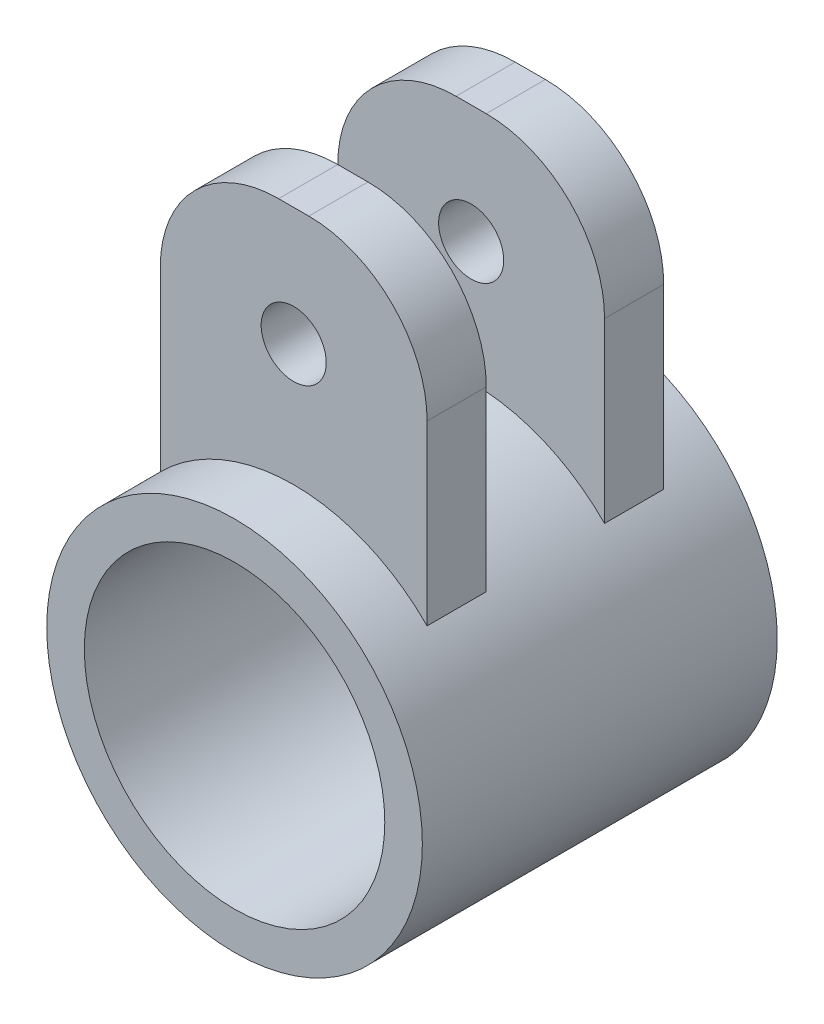
ISO-10303-21;
HEADER;
FILE_DESCRIPTION(('STEP AP214'),'2;1');
FILE_NAME('part.step','',(''),(''),'','','');
FILE_SCHEMA(('AUTOMOTIVE_DESIGN { 1 0 10303 214 1 1 1 1 }'));
ENDSEC;
DATA;
#1=APPLICATION_CONTEXT('core data for automotive mechanical design processes');
#2=APPLICATION_PROTOCOL_DEFINITION('international standard','automotive_design',2000,#1);
#3=PRODUCT_CONTEXT('',#1,'mechanical');
#4=PRODUCT('Part','Part','',(#3));
#5=PRODUCT_RELATED_PRODUCT_CATEGORY('part','',(#4));
#6=PRODUCT_DEFINITION_FORMATION('','',#4);
#7=PRODUCT_DEFINITION_CONTEXT('part definition',#1,'design');
#8=PRODUCT_DEFINITION('design','',#6,#7);
#9=PRODUCT_DEFINITION_SHAPE('','',#8);
#10=(LENGTH_UNIT() NAMED_UNIT(*) SI_UNIT(.MILLI.,.METRE.));
#11=(NAMED_UNIT(*) PLANE_ANGLE_UNIT() SI_UNIT($,.RADIAN.));
#12=(NAMED_UNIT(*) SI_UNIT($,.STERADIAN.) SOLID_ANGLE_UNIT());
#13=UNCERTAINTY_MEASURE_WITH_UNIT(LENGTH_MEASURE(1.E-05),#10,'distance_accuracy_value','');
#14=(GEOMETRIC_REPRESENTATION_CONTEXT(3) GLOBAL_UNCERTAINTY_ASSIGNED_CONTEXT((#13)) GLOBAL_UNIT_ASSIGNED_CONTEXT((#10,
#11,#12)) REPRESENTATION_CONTEXT('',''));
#15=CARTESIAN_POINT('',(0.,0.,0.));
#16=DIRECTION('',(0.,0.,1.));
#17=DIRECTION('',(1.,0.,0.));
#18=AXIS2_PLACEMENT_3D('',#15,#16,#17);
#19=CARTESIAN_POINT('',(11.2764008479815,11.1740059475393,10.));
#20=DIRECTION('',(-1.,0.,0.));
#21=DIRECTION('',(0.,-1.,0.));
#22=AXIS2_PLACEMENT_3D('',#19,#20,#21);
#23=PLANE('',#22);
#24=DIRECTION('',(0.,1.,0.));
#25=VECTOR('',#24,1.);
#26=CARTESIAN_POINT('',(11.2764008479815,11.1740059475393,-5.));
#27=LINE('',#26,#25);
#28=CARTESIAN_POINT('',(11.2764008479815,11.1740059475393,-5.));
#29=VERTEX_POINT('',#28);
#30=CARTESIAN_POINT('',(11.2764008479815,26.1740059475392,-5.));
#31=VERTEX_POINT('',#30);
#32=EDGE_CURVE('E130',#29,#31,#27,.T.);
#33=ORIENTED_EDGE('',*,*,#32,.F.);
#34=DIRECTION('',(0.,0.,-1.));
#35=VECTOR('',#34,1.);
#36=CARTESIAN_POINT('',(11.2764008479815,11.1740059475393,10.));
#37=LINE('',#36,#35);
#38=CARTESIAN_POINT('',(11.2764008479815,11.1740059475393,-10.));
#39=VERTEX_POINT('',#38);
#40=EDGE_CURVE('E142',#29,#39,#37,.T.);
#41=ORIENTED_EDGE('',*,*,#40,.T.);
#42=DIRECTION('',(0.,1.,0.));
#43=VECTOR('',#42,1.);
#44=CARTESIAN_POINT('',(11.2764008479815,11.1740059475393,-10.));
#45=LINE('',#44,#43);
#46=CARTESIAN_POINT('',(11.2764008479815,26.1740059475392,-10.));
#47=VERTEX_POINT('',#46);
#48=EDGE_CURVE('E281',#39,#47,#45,.T.);
#49=ORIENTED_EDGE('',*,*,#48,.T.);
#50=DIRECTION('',(0.,0.,-1.));
#51=VECTOR('',#50,1.);
#52=CARTESIAN_POINT('',(11.2764008479815,26.1740059475392,10.));
#53=LINE('',#52,#51);
#54=EDGE_CURVE('E144',#31,#47,#53,.T.);
#55=ORIENTED_EDGE('',*,*,#54,.F.);
#56=EDGE_LOOP('',(#33,#41,#49,#55));
#57=FACE_BOUND('',#56,.T.);
#58=ADVANCED_FACE('F37',(#57),#23,.F.);
#59=CARTESIAN_POINT('',(1.27640084798146,26.1740059475393,10.));
#60=DIRECTION('',(0.,0.,-1.));
#61=DIRECTION('',(-1.,0.,0.));
#62=AXIS2_PLACEMENT_3D('',#59,#60,#61);
#63=CYLINDRICAL_SURFACE('',#62,10.);
#64=CARTESIAN_POINT('',(1.27640084798146,26.1740059475393,-5.));
#65=DIRECTION('',(0.,0.,1.));
#66=DIRECTION('',(-1.,0.,0.));
#67=AXIS2_PLACEMENT_3D('',#64,#65,#66);
#68=CIRCLE('',#67,10.);
#69=CARTESIAN_POINT('',(1.27640084798139,36.1740059475393,-5.));
#70=VERTEX_POINT('',#69);
#71=EDGE_CURVE('E145',#31,#70,#68,.T.);
#72=ORIENTED_EDGE('',*,*,#71,.F.);
#73=ORIENTED_EDGE('',*,*,#54,.T.);
#74=CARTESIAN_POINT('',(1.27640084798146,26.1740059475393,-10.));
#75=DIRECTION('',(0.,0.,1.));
#76=DIRECTION('',(-1.,0.,0.));
#77=AXIS2_PLACEMENT_3D('',#74,#75,#76);
#78=CIRCLE('',#77,10.);
#79=CARTESIAN_POINT('',(1.27640084798139,36.1740059475393,-10.));
#80=VERTEX_POINT('',#79);
#81=EDGE_CURVE('E283',#47,#80,#78,.T.);
#82=ORIENTED_EDGE('',*,*,#81,.T.);
#83=DIRECTION('',(0.,0.,-1.));
#84=VECTOR('',#83,1.);
#85=CARTESIAN_POINT('',(1.27640084798139,36.1740059475393,10.));
#86=LINE('',#85,#84);
#87=EDGE_CURVE('E304',#70,#80,#86,.T.);
#88=ORIENTED_EDGE('',*,*,#87,.F.);
#89=EDGE_LOOP('',(#72,#73,#82,#88));
#90=FACE_BOUND('',#89,.T.);
#91=ADVANCED_FACE('F186',(#90),#63,.T.);
#92=CARTESIAN_POINT('',(-1.27640084798139,36.1740059475393,10.));
#93=DIRECTION('',(0.,-1.,0.));
#94=DIRECTION('',(0.,0.,-1.));
#95=AXIS2_PLACEMENT_3D('',#92,#93,#94);
#96=PLANE('',#95);
#97=DIRECTION('',(-1.,0.,0.));
#98=VECTOR('',#97,1.);
#99=CARTESIAN_POINT('',(-1.27640084798139,36.1740059475393,-5.));
#100=LINE('',#99,#98);
#101=CARTESIAN_POINT('',(-1.27640084798139,36.1740059475393,-5.));
#102=VERTEX_POINT('',#101);
#103=EDGE_CURVE('E247',#70,#102,#100,.T.);
#104=ORIENTED_EDGE('',*,*,#103,.F.);
#105=ORIENTED_EDGE('',*,*,#87,.T.);
#106=DIRECTION('',(-1.,0.,0.));
#107=VECTOR('',#106,1.);
#108=CARTESIAN_POINT('',(-1.27640084798139,36.1740059475393,-10.));
#109=LINE('',#108,#107);
#110=CARTESIAN_POINT('',(-1.27640084798139,36.1740059475393,-10.));
#111=VERTEX_POINT('',#110);
#112=EDGE_CURVE('E286',#80,#111,#109,.T.);
#113=ORIENTED_EDGE('',*,*,#112,.T.);
#114=DIRECTION('',(0.,0.,-1.));
#115=VECTOR('',#114,1.);
#116=CARTESIAN_POINT('',(-1.27640084798139,36.1740059475393,10.));
#117=LINE('',#116,#115);
#118=EDGE_CURVE('E301',#102,#111,#117,.T.);
#119=ORIENTED_EDGE('',*,*,#118,.F.);
#120=EDGE_LOOP('',(#104,#105,#113,#119));
#121=FACE_BOUND('',#120,.T.);
#122=ADVANCED_FACE('F190',(#121),#96,.F.);
#123=CARTESIAN_POINT('',(-1.27640084798146,26.1740059475393,10.));
#124=DIRECTION('',(0.,0.,-1.));
#125=DIRECTION('',(-1.,0.,0.));
#126=AXIS2_PLACEMENT_3D('',#123,#124,#125);
#127=CYLINDRICAL_SURFACE('',#126,10.);
#128=CARTESIAN_POINT('',(-1.27640084798146,26.1740059475393,-5.));
#129=DIRECTION('',(0.,0.,1.));
#130=DIRECTION('',(-1.,0.,0.));
#131=AXIS2_PLACEMENT_3D('',#128,#129,#130);
#132=CIRCLE('',#131,10.);
#133=CARTESIAN_POINT('',(-11.2764008479815,26.1740059475392,-5.));
#134=VERTEX_POINT('',#133);
#135=EDGE_CURVE('E249',#102,#134,#132,.T.);
#136=ORIENTED_EDGE('',*,*,#135,.F.);
#137=ORIENTED_EDGE('',*,*,#118,.T.);
#138=CARTESIAN_POINT('',(-1.27640084798146,26.1740059475393,-10.));
#139=DIRECTION('',(0.,0.,1.));
#140=DIRECTION('',(-1.,0.,0.));
#141=AXIS2_PLACEMENT_3D('',#138,#139,#140);
#142=CIRCLE('',#141,10.);
#143=CARTESIAN_POINT('',(-11.2764008479815,26.1740059475392,-10.));
#144=VERTEX_POINT('',#143);
#145=EDGE_CURVE('E289',#111,#144,#142,.T.);
#146=ORIENTED_EDGE('',*,*,#145,.T.);
#147=DIRECTION('',(0.,0.,-1.));
#148=VECTOR('',#147,1.);
#149=CARTESIAN_POINT('',(-11.2764008479815,26.1740059475392,10.));
#150=LINE('',#149,#148);
#151=EDGE_CURVE('E297',#134,#144,#150,.T.);
#152=ORIENTED_EDGE('',*,*,#151,.F.);
#153=EDGE_LOOP('',(#136,#137,#146,#152));
#154=FACE_BOUND('',#153,.T.);
#155=ADVANCED_FACE('F205',(#154),#127,.T.);
#156=CARTESIAN_POINT('',(-11.2764008479815,11.1740059475393,10.));
#157=DIRECTION('',(1.,0.,0.));
#158=DIRECTION('',(0.,0.,-1.));
#159=AXIS2_PLACEMENT_3D('',#156,#157,#158);
#160=PLANE('',#159);
#161=DIRECTION('',(0.,-1.,0.));
#162=VECTOR('',#161,1.);
#163=CARTESIAN_POINT('',(-11.2764008479815,11.1740059475393,-5.));
#164=LINE('',#163,#162);
#165=CARTESIAN_POINT('',(-11.2764008479815,11.1740059475393,-5.));
#166=VERTEX_POINT('',#165);
#167=EDGE_CURVE('E133',#134,#166,#164,.T.);
#168=ORIENTED_EDGE('',*,*,#167,.F.);
#169=ORIENTED_EDGE('',*,*,#151,.T.);
#170=DIRECTION('',(0.,-1.,0.));
#171=VECTOR('',#170,1.);
#172=CARTESIAN_POINT('',(-11.2764008479815,11.1740059475393,-10.));
#173=LINE('',#172,#171);
#174=CARTESIAN_POINT('',(-11.2764008479815,11.1740059475393,-10.));
#175=VERTEX_POINT('',#174);
#176=EDGE_CURVE('E268',#144,#175,#173,.T.);
#177=ORIENTED_EDGE('',*,*,#176,.T.);
#178=DIRECTION('',(0.,0.,-1.));
#179=VECTOR('',#178,1.);
#180=CARTESIAN_POINT('',(-11.2764008479815,11.1740059475393,10.));
#181=LINE('',#180,#179);
#182=EDGE_CURVE('E279',#166,#175,#181,.T.);
#183=ORIENTED_EDGE('',*,*,#182,.F.);
#184=EDGE_LOOP('',(#168,#169,#177,#183));
#185=FACE_BOUND('',#184,.T.);
#186=ADVANCED_FACE('F210',(#185),#160,.F.);
#187=CARTESIAN_POINT('',(0.,0.,15.));
#188=DIRECTION('',(0.,0.,1.));
#189=DIRECTION('',(1.,0.,0.));
#190=AXIS2_PLACEMENT_3D('',#187,#188,#189);
#191=PLANE('',#190);
#192=CARTESIAN_POINT('',(0.,0.,15.));
#193=DIRECTION('',(0.,0.,1.));
#194=DIRECTION('',(1.,0.,0.));
#195=AXIS2_PLACEMENT_3D('',#192,#193,#194);
#196=CIRCLE('',#195,15.875);
#197=CARTESIAN_POINT('',(15.875,0.,15.));
#198=VERTEX_POINT('',#197);
#199=EDGE_CURVE('E11',#198,#198,#196,.T.);
#200=ORIENTED_EDGE('',*,*,#199,.T.);
#201=EDGE_LOOP('',(#200));
#202=FACE_BOUND('',#201,.T.);
#203=CARTESIAN_POINT('',(0.,0.,15.));
#204=DIRECTION('',(0.,0.,1.));
#205=DIRECTION('',(1.,0.,0.));
#206=AXIS2_PLACEMENT_3D('',#203,#204,#205);
#207=CIRCLE('',#206,12.7);
#208=CARTESIAN_POINT('',(12.7,0.,15.));
#209=VERTEX_POINT('',#208);
#210=EDGE_CURVE('E158',#209,#209,#207,.T.);
#211=ORIENTED_EDGE('',*,*,#210,.F.);
#212=EDGE_LOOP('',(#211));
#213=FACE_BOUND('',#212,.T.);
#214=ADVANCED_FACE('F169',(#202,#213),#191,.T.);
#215=CARTESIAN_POINT('',(0.,0.,-15.));
#216=DIRECTION('',(0.,0.,1.));
#217=DIRECTION('',(1.,0.,0.));
#218=AXIS2_PLACEMENT_3D('',#215,#216,#217);
#219=PLANE('',#218);
#220=CARTESIAN_POINT('',(0.,0.,-15.));
#221=DIRECTION('',(0.,0.,1.));
#222=DIRECTION('',(1.,0.,0.));
#223=AXIS2_PLACEMENT_3D('',#220,#221,#222);
#224=CIRCLE('',#223,15.875);
#225=CARTESIAN_POINT('',(15.875,0.,-15.));
#226=VERTEX_POINT('',#225);
#227=EDGE_CURVE('E46',#226,#226,#224,.T.);
#228=ORIENTED_EDGE('',*,*,#227,.F.);
#229=EDGE_LOOP('',(#228));
#230=FACE_BOUND('',#229,.T.);
#231=CARTESIAN_POINT('',(0.,0.,-15.));
#232=DIRECTION('',(0.,0.,1.));
#233=DIRECTION('',(1.,0.,0.));
#234=AXIS2_PLACEMENT_3D('',#231,#232,#233);
#235=CIRCLE('',#234,12.7);
#236=CARTESIAN_POINT('',(12.7,0.,-15.));
#237=VERTEX_POINT('',#236);
#238=EDGE_CURVE('E153',#237,#237,#235,.T.);
#239=ORIENTED_EDGE('',*,*,#238,.T.);
#240=EDGE_LOOP('',(#239));
#241=FACE_BOUND('',#240,.T.);
#242=ADVANCED_FACE('F166',(#230,#241),#219,.F.);
#243=CARTESIAN_POINT('',(0.,0.,15.));
#244=DIRECTION('',(0.,0.,-1.));
#245=DIRECTION('',(-1.,0.,0.));
#246=AXIS2_PLACEMENT_3D('',#243,#244,#245);
#247=CYLINDRICAL_SURFACE('',#246,15.875);
#248=CARTESIAN_POINT('',(0.,0.,5.));
#249=DIRECTION('',(0.,0.,-1.));
#250=DIRECTION('',(1.,0.,0.));
#251=AXIS2_PLACEMENT_3D('',#248,#249,#250);
#252=CIRCLE('',#251,15.875);
#253=CARTESIAN_POINT('',(-11.2764008479815,11.1740059475393,5.));
#254=VERTEX_POINT('',#253);
#255=CARTESIAN_POINT('',(11.2764008479815,11.1740059475393,5.));
#256=VERTEX_POINT('',#255);
#257=EDGE_CURVE('E54',#254,#256,#252,.T.);
#258=ORIENTED_EDGE('',*,*,#257,.T.);
#259=CARTESIAN_POINT('',(11.2764008479815,11.1740059475393,10.));
#260=VERTEX_POINT('',#259);
#261=EDGE_CURVE('E61',#260,#256,#37,.T.);
#262=ORIENTED_EDGE('',*,*,#261,.F.);
#263=CARTESIAN_POINT('',(0.,0.,10.));
#264=DIRECTION('',(0.,0.,-1.));
#265=DIRECTION('',(1.,0.,0.));
#266=AXIS2_PLACEMENT_3D('',#263,#264,#265);
#267=CIRCLE('',#266,15.875);
#268=CARTESIAN_POINT('',(-11.2764008479815,11.1740059475393,10.));
#269=VERTEX_POINT('',#268);
#270=EDGE_CURVE('E264',#269,#260,#267,.T.);
#271=ORIENTED_EDGE('',*,*,#270,.F.);
#272=EDGE_CURVE('E294',#269,#254,#181,.T.);
#273=ORIENTED_EDGE('',*,*,#272,.T.);
#274=EDGE_LOOP('',(#258,#262,#271,#273));
#275=FACE_BOUND('',#274,.T.);
#276=ORIENTED_EDGE('',*,*,#40,.F.);
#277=CARTESIAN_POINT('',(0.,0.,-5.));
#278=DIRECTION('',(0.,0.,-1.));
#279=DIRECTION('',(1.,0.,0.));
#280=AXIS2_PLACEMENT_3D('',#277,#278,#279);
#281=CIRCLE('',#280,15.875);
#282=EDGE_CURVE('E127',#166,#29,#281,.T.);
#283=ORIENTED_EDGE('',*,*,#282,.F.);
#284=ORIENTED_EDGE('',*,*,#182,.T.);
#285=CARTESIAN_POINT('',(0.,0.,-10.));
#286=DIRECTION('',(0.,0.,-1.));
#287=DIRECTION('',(1.,0.,0.));
#288=AXIS2_PLACEMENT_3D('',#285,#286,#287);
#289=CIRCLE('',#288,15.875);
#290=EDGE_CURVE('E149',#175,#39,#289,.T.);
#291=ORIENTED_EDGE('',*,*,#290,.T.);
#292=EDGE_LOOP('',(#276,#283,#284,#291));
#293=FACE_BOUND('',#292,.T.);
#294=ORIENTED_EDGE('',*,*,#199,.F.);
#295=EDGE_LOOP('',(#294));
#296=FACE_BOUND('',#295,.T.);
#297=ORIENTED_EDGE('',*,*,#227,.T.);
#298=EDGE_LOOP('',(#297));
#299=FACE_BOUND('',#298,.T.);
#300=ADVANCED_FACE('F39',(#275,#293,#296,#299),#247,.T.);
#301=CARTESIAN_POINT('',(0.,0.,15.));
#302=DIRECTION('',(0.,0.,-1.));
#303=DIRECTION('',(-1.,0.,0.));
#304=AXIS2_PLACEMENT_3D('',#301,#302,#303);
#305=CYLINDRICAL_SURFACE('',#304,12.7);
#306=ORIENTED_EDGE('',*,*,#210,.T.);
#307=EDGE_LOOP('',(#306));
#308=FACE_BOUND('',#307,.T.);
#309=ORIENTED_EDGE('',*,*,#238,.F.);
#310=EDGE_LOOP('',(#309));
#311=FACE_BOUND('',#310,.T.);
#312=ADVANCED_FACE('F172',(#308,#311),#305,.F.);
#313=ORIENTED_EDGE('',*,*,#261,.T.);
#314=DIRECTION('',(0.,1.,0.));
#315=VECTOR('',#314,1.);
#316=CARTESIAN_POINT('',(11.2764008479815,11.1740059475393,5.));
#317=LINE('',#316,#315);
#318=CARTESIAN_POINT('',(11.2764008479815,26.1740059475392,5.));
#319=VERTEX_POINT('',#318);
#320=EDGE_CURVE('E241',#256,#319,#317,.T.);
#321=ORIENTED_EDGE('',*,*,#320,.T.);
#322=CARTESIAN_POINT('',(11.2764008479815,26.1740059475392,10.));
#323=VERTEX_POINT('',#322);
#324=EDGE_CURVE('E151',#323,#319,#53,.T.);
#325=ORIENTED_EDGE('',*,*,#324,.F.);
#326=DIRECTION('',(0.,1.,0.));
#327=VECTOR('',#326,1.);
#328=CARTESIAN_POINT('',(11.2764008479815,11.1740059475393,10.));
#329=LINE('',#328,#327);
#330=EDGE_CURVE('E267',#260,#323,#329,.T.);
#331=ORIENTED_EDGE('',*,*,#330,.F.);
#332=EDGE_LOOP('',(#313,#321,#325,#331));
#333=FACE_BOUND('',#332,.T.);
#334=ADVANCED_FACE('F174',(#333),#23,.F.);
#335=ORIENTED_EDGE('',*,*,#324,.T.);
#336=CARTESIAN_POINT('',(1.27640084798146,26.1740059475393,5.));
#337=DIRECTION('',(0.,0.,1.));
#338=DIRECTION('',(-1.,0.,0.));
#339=AXIS2_PLACEMENT_3D('',#336,#337,#338);
#340=CIRCLE('',#339,10.);
#341=CARTESIAN_POINT('',(1.27640084798139,36.1740059475393,5.));
#342=VERTEX_POINT('',#341);
#343=EDGE_CURVE('E254',#319,#342,#340,.T.);
#344=ORIENTED_EDGE('',*,*,#343,.T.);
#345=CARTESIAN_POINT('',(1.27640084798139,36.1740059475393,10.));
#346=VERTEX_POINT('',#345);
#347=EDGE_CURVE('E305',#346,#342,#86,.T.);
#348=ORIENTED_EDGE('',*,*,#347,.F.);
#349=CARTESIAN_POINT('',(1.27640084798146,26.1740059475393,10.));
#350=DIRECTION('',(0.,0.,1.));
#351=DIRECTION('',(-1.,0.,0.));
#352=AXIS2_PLACEMENT_3D('',#349,#350,#351);
#353=CIRCLE('',#352,10.);
#354=EDGE_CURVE('E270',#323,#346,#353,.T.);
#355=ORIENTED_EDGE('',*,*,#354,.F.);
#356=EDGE_LOOP('',(#335,#344,#348,#355));
#357=FACE_BOUND('',#356,.T.);
#358=ADVANCED_FACE('F181',(#357),#63,.T.);
#359=ORIENTED_EDGE('',*,*,#347,.T.);
#360=DIRECTION('',(-1.,0.,0.));
#361=VECTOR('',#360,1.);
#362=CARTESIAN_POINT('',(-1.27640084798139,36.1740059475393,5.));
#363=LINE('',#362,#361);
#364=CARTESIAN_POINT('',(-1.27640084798139,36.1740059475393,5.));
#365=VERTEX_POINT('',#364);
#366=EDGE_CURVE('E257',#342,#365,#363,.T.);
#367=ORIENTED_EDGE('',*,*,#366,.T.);
#368=CARTESIAN_POINT('',(-1.27640084798139,36.1740059475393,10.));
#369=VERTEX_POINT('',#368);
#370=EDGE_CURVE('E302',#369,#365,#117,.T.);
#371=ORIENTED_EDGE('',*,*,#370,.F.);
#372=DIRECTION('',(-1.,0.,0.));
#373=VECTOR('',#372,1.);
#374=CARTESIAN_POINT('',(-1.27640084798139,36.1740059475393,10.));
#375=LINE('',#374,#373);
#376=EDGE_CURVE('E272',#346,#369,#375,.T.);
#377=ORIENTED_EDGE('',*,*,#376,.F.);
#378=EDGE_LOOP('',(#359,#367,#371,#377));
#379=FACE_BOUND('',#378,.T.);
#380=ADVANCED_FACE('F195',(#379),#96,.F.);
#381=ORIENTED_EDGE('',*,*,#370,.T.);
#382=CARTESIAN_POINT('',(-1.27640084798146,26.1740059475393,5.));
#383=DIRECTION('',(0.,0.,1.));
#384=DIRECTION('',(-1.,0.,0.));
#385=AXIS2_PLACEMENT_3D('',#382,#383,#384);
#386=CIRCLE('',#385,10.);
#387=CARTESIAN_POINT('',(-11.2764008479815,26.1740059475392,5.));
#388=VERTEX_POINT('',#387);
#389=EDGE_CURVE('E260',#365,#388,#386,.T.);
#390=ORIENTED_EDGE('',*,*,#389,.T.);
#391=CARTESIAN_POINT('',(-11.2764008479815,26.1740059475392,10.));
#392=VERTEX_POINT('',#391);
#393=EDGE_CURVE('E298',#392,#388,#150,.T.);
#394=ORIENTED_EDGE('',*,*,#393,.F.);
#395=CARTESIAN_POINT('',(-1.27640084798146,26.1740059475393,10.));
#396=DIRECTION('',(0.,0.,1.));
#397=DIRECTION('',(-1.,0.,0.));
#398=AXIS2_PLACEMENT_3D('',#395,#396,#397);
#399=CIRCLE('',#398,10.);
#400=EDGE_CURVE('E274',#369,#392,#399,.T.);
#401=ORIENTED_EDGE('',*,*,#400,.F.);
#402=EDGE_LOOP('',(#381,#390,#394,#401));
#403=FACE_BOUND('',#402,.T.);
#404=ADVANCED_FACE('F199',(#403),#127,.T.);
#405=ORIENTED_EDGE('',*,*,#393,.T.);
#406=DIRECTION('',(0.,-1.,0.));
#407=VECTOR('',#406,1.);
#408=CARTESIAN_POINT('',(-11.2764008479815,11.1740059475393,5.));
#409=LINE('',#408,#407);
#410=EDGE_CURVE('E137',#388,#254,#409,.T.);
#411=ORIENTED_EDGE('',*,*,#410,.T.);
#412=ORIENTED_EDGE('',*,*,#272,.F.);
#413=DIRECTION('',(0.,-1.,0.));
#414=VECTOR('',#413,1.);
#415=CARTESIAN_POINT('',(-11.2764008479815,11.1740059475393,10.));
#416=LINE('',#415,#414);
#417=EDGE_CURVE('E276',#392,#269,#416,.T.);
#418=ORIENTED_EDGE('',*,*,#417,.F.);
#419=EDGE_LOOP('',(#405,#411,#412,#418));
#420=FACE_BOUND('',#419,.T.);
#421=ADVANCED_FACE('F203',(#420),#160,.F.);
#422=CARTESIAN_POINT('',(0.,0.,10.));
#423=DIRECTION('',(0.,0.,1.));
#424=DIRECTION('',(1.,0.,0.));
#425=AXIS2_PLACEMENT_3D('',#422,#423,#424);
#426=PLANE('',#425);
#427=CARTESIAN_POINT('',(0.,26.1740059475393,10.));
#428=DIRECTION('',(0.,0.,1.));
#429=DIRECTION('',(1.,0.,0.));
#430=AXIS2_PLACEMENT_3D('',#427,#428,#429);
#431=CIRCLE('',#430,2.74999999999999);
#432=CARTESIAN_POINT('',(2.74999999999999,26.1740059475393,10.));
#433=VERTEX_POINT('',#432);
#434=EDGE_CURVE('E495',#433,#433,#431,.T.);
#435=ORIENTED_EDGE('',*,*,#434,.F.);
#436=EDGE_LOOP('',(#435));
#437=FACE_BOUND('',#436,.T.);
#438=ORIENTED_EDGE('',*,*,#270,.T.);
#439=ORIENTED_EDGE('',*,*,#330,.T.);
#440=ORIENTED_EDGE('',*,*,#354,.T.);
#441=ORIENTED_EDGE('',*,*,#376,.T.);
#442=ORIENTED_EDGE('',*,*,#400,.T.);
#443=ORIENTED_EDGE('',*,*,#417,.T.);
#444=EDGE_LOOP('',(#438,#439,#440,#441,#442,#443));
#445=FACE_BOUND('',#444,.T.);
#446=ADVANCED_FACE('F208',(#437,#445),#426,.T.);
#447=CARTESIAN_POINT('',(0.,0.,-10.));
#448=DIRECTION('',(0.,0.,1.));
#449=DIRECTION('',(1.,0.,0.));
#450=AXIS2_PLACEMENT_3D('',#447,#448,#449);
#451=PLANE('',#450);
#452=CARTESIAN_POINT('',(0.,26.1740059475393,-10.));
#453=DIRECTION('',(0.,0.,1.));
#454=DIRECTION('',(1.,0.,0.));
#455=AXIS2_PLACEMENT_3D('',#452,#453,#454);
#456=CIRCLE('',#455,2.74999999999999);
#457=CARTESIAN_POINT('',(2.74999999999999,26.1740059475393,-10.));
#458=VERTEX_POINT('',#457);
#459=EDGE_CURVE('E239',#458,#458,#456,.T.);
#460=ORIENTED_EDGE('',*,*,#459,.T.);
#461=EDGE_LOOP('',(#460));
#462=FACE_BOUND('',#461,.T.);
#463=ORIENTED_EDGE('',*,*,#290,.F.);
#464=ORIENTED_EDGE('',*,*,#176,.F.);
#465=ORIENTED_EDGE('',*,*,#145,.F.);
#466=ORIENTED_EDGE('',*,*,#112,.F.);
#467=ORIENTED_EDGE('',*,*,#81,.F.);
#468=ORIENTED_EDGE('',*,*,#48,.F.);
#469=EDGE_LOOP('',(#463,#464,#465,#466,#467,#468));
#470=FACE_BOUND('',#469,.T.);
#471=ADVANCED_FACE('F211',(#462,#470),#451,.F.);
#472=CARTESIAN_POINT('',(0.,0.,-5.));
#473=DIRECTION('',(0.,0.,1.));
#474=DIRECTION('',(1.,0.,0.));
#475=AXIS2_PLACEMENT_3D('',#472,#473,#474);
#476=PLANE('',#475);
#477=CARTESIAN_POINT('',(0.,26.1740059475393,-5.));
#478=DIRECTION('',(0.,0.,1.));
#479=DIRECTION('',(1.,0.,0.));
#480=AXIS2_PLACEMENT_3D('',#477,#478,#479);
#481=CIRCLE('',#480,2.74999999999999);
#482=CARTESIAN_POINT('',(2.74999999999999,26.1740059475393,-5.));
#483=VERTEX_POINT('',#482);
#484=EDGE_CURVE('E236',#483,#483,#481,.T.);
#485=ORIENTED_EDGE('',*,*,#484,.F.);
#486=EDGE_LOOP('',(#485));
#487=FACE_BOUND('',#486,.T.);
#488=ORIENTED_EDGE('',*,*,#282,.T.);
#489=ORIENTED_EDGE('',*,*,#32,.T.);
#490=ORIENTED_EDGE('',*,*,#71,.T.);
#491=ORIENTED_EDGE('',*,*,#103,.T.);
#492=ORIENTED_EDGE('',*,*,#135,.T.);
#493=ORIENTED_EDGE('',*,*,#167,.T.);
#494=EDGE_LOOP('',(#488,#489,#490,#491,#492,#493));
#495=FACE_BOUND('',#494,.T.);
#496=ADVANCED_FACE('F129',(#487,#495),#476,.T.);
#497=CARTESIAN_POINT('',(0.,0.,5.));
#498=DIRECTION('',(0.,0.,1.));
#499=DIRECTION('',(1.,0.,0.));
#500=AXIS2_PLACEMENT_3D('',#497,#498,#499);
#501=PLANE('',#500);
#502=CARTESIAN_POINT('',(0.,26.1740059475393,5.));
#503=DIRECTION('',(0.,0.,1.));
#504=DIRECTION('',(1.,0.,0.));
#505=AXIS2_PLACEMENT_3D('',#502,#503,#504);
#506=CIRCLE('',#505,2.74999999999999);
#507=CARTESIAN_POINT('',(2.74999999999999,26.1740059475393,5.));
#508=VERTEX_POINT('',#507);
#509=EDGE_CURVE('E41',#508,#508,#506,.T.);
#510=ORIENTED_EDGE('',*,*,#509,.T.);
#511=EDGE_LOOP('',(#510));
#512=FACE_BOUND('',#511,.T.);
#513=ORIENTED_EDGE('',*,*,#257,.F.);
#514=ORIENTED_EDGE('',*,*,#410,.F.);
#515=ORIENTED_EDGE('',*,*,#389,.F.);
#516=ORIENTED_EDGE('',*,*,#366,.F.);
#517=ORIENTED_EDGE('',*,*,#343,.F.);
#518=ORIENTED_EDGE('',*,*,#320,.F.);
#519=EDGE_LOOP('',(#513,#514,#515,#516,#517,#518));
#520=FACE_BOUND('',#519,.T.);
#521=ADVANCED_FACE('F218',(#512,#520),#501,.F.);
#522=CARTESIAN_POINT('',(0.,26.1740059475393,10.));
#523=DIRECTION('',(0.,0.,1.));
#524=DIRECTION('',(1.,0.,0.));
#525=AXIS2_PLACEMENT_3D('',#522,#523,#524);
#526=CYLINDRICAL_SURFACE('',#525,2.74999999999999);
#527=ORIENTED_EDGE('',*,*,#434,.T.);
#528=EDGE_LOOP('',(#527));
#529=FACE_BOUND('',#528,.T.);
#530=ORIENTED_EDGE('',*,*,#509,.F.);
#531=EDGE_LOOP('',(#530));
#532=FACE_BOUND('',#531,.T.);
#533=ADVANCED_FACE('F221',(#529,#532),#526,.F.);
#534=ORIENTED_EDGE('',*,*,#484,.T.);
#535=EDGE_LOOP('',(#534));
#536=FACE_BOUND('',#535,.T.);
#537=ORIENTED_EDGE('',*,*,#459,.F.);
#538=EDGE_LOOP('',(#537));
#539=FACE_BOUND('',#538,.T.);
#540=ADVANCED_FACE('F226',(#536,#539),#526,.F.);
#541=CLOSED_SHELL('',(#58,#91,#122,#155,#186,#214,#242,#300,#312,#334,#358,#380,#404,#421,#446,
#471,#496,#521,#533,#540));
#542=MANIFOLD_SOLID_BREP('B2',#541);
#543=ADVANCED_BREP_SHAPE_REPRESENTATION('',(#18,#542),#14);
#544=SHAPE_DEFINITION_REPRESENTATION(#9,#543);
ENDSEC;
END-ISO-10303-21;
